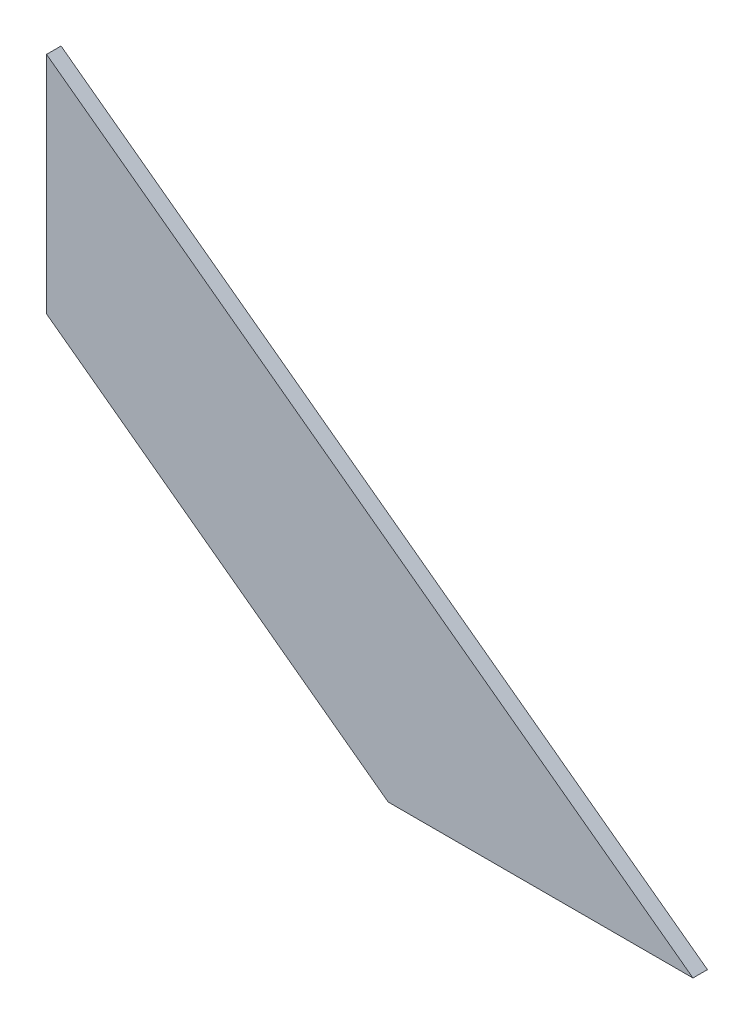
ISO-10303-21;
HEADER;
FILE_DESCRIPTION(('STEP AP214'),'2;1');
FILE_NAME('part.step','',(''),(''),'','','');
FILE_SCHEMA(('AUTOMOTIVE_DESIGN { 1 0 10303 214 1 1 1 1 }'));
ENDSEC;
DATA;
#1=APPLICATION_CONTEXT('core data for automotive mechanical design processes');
#2=APPLICATION_PROTOCOL_DEFINITION('international standard','automotive_design',2000,#1);
#3=PRODUCT_CONTEXT('',#1,'mechanical');
#4=PRODUCT('Part','Part','',(#3));
#5=PRODUCT_RELATED_PRODUCT_CATEGORY('part','',(#4));
#6=PRODUCT_DEFINITION_FORMATION('','',#4);
#7=PRODUCT_DEFINITION_CONTEXT('part definition',#1,'design');
#8=PRODUCT_DEFINITION('design','',#6,#7);
#9=PRODUCT_DEFINITION_SHAPE('','',#8);
#10=(LENGTH_UNIT() NAMED_UNIT(*) SI_UNIT(.MILLI.,.METRE.));
#11=(NAMED_UNIT(*) PLANE_ANGLE_UNIT() SI_UNIT($,.RADIAN.));
#12=(NAMED_UNIT(*) SI_UNIT($,.STERADIAN.) SOLID_ANGLE_UNIT());
#13=UNCERTAINTY_MEASURE_WITH_UNIT(LENGTH_MEASURE(1.E-05),#10,'distance_accuracy_value','');
#14=(GEOMETRIC_REPRESENTATION_CONTEXT(3) GLOBAL_UNCERTAINTY_ASSIGNED_CONTEXT((#13)) GLOBAL_UNIT_ASSIGNED_CONTEXT((#10,
#11,#12)) REPRESENTATION_CONTEXT('',''));
#15=CARTESIAN_POINT('',(0.,0.,0.));
#16=DIRECTION('',(0.,0.,1.));
#17=DIRECTION('',(1.,0.,0.));
#18=AXIS2_PLACEMENT_3D('',#15,#16,#17);
#19=CARTESIAN_POINT('',(-503.389866918467,-20.0348288869536,-1.524));
#20=DIRECTION('',(0.,1.,0.));
#21=DIRECTION('',(-1.,0.,0.));
#22=AXIS2_PLACEMENT_3D('',#19,#20,#21);
#23=PLANE('',#22);
#24=DIRECTION('',(-1.,0.,0.));
#25=VECTOR('',#24,1.);
#26=CARTESIAN_POINT('',(-503.389866918467,-20.0348288869536,0.));
#27=LINE('',#26,#25);
#28=CARTESIAN_POINT('',(-471.292522592368,-20.0348288869538,0.));
#29=VERTEX_POINT('',#28);
#30=CARTESIAN_POINT('',(-503.389866918467,-20.0348288869536,0.));
#31=VERTEX_POINT('',#30);
#32=EDGE_CURVE('E96',#29,#31,#27,.T.);
#33=ORIENTED_EDGE('',*,*,#32,.T.);
#34=DIRECTION('',(0.,0.,1.));
#35=VECTOR('',#34,1.);
#36=CARTESIAN_POINT('',(-503.389866918467,-20.0348288869536,-1.524));
#37=LINE('',#36,#35);
#38=CARTESIAN_POINT('',(-503.389866918467,-20.0348288869536,-1.524));
#39=VERTEX_POINT('',#38);
#40=EDGE_CURVE('E11',#39,#31,#37,.T.);
#41=ORIENTED_EDGE('',*,*,#40,.F.);
#42=DIRECTION('',(-1.,0.,0.));
#43=VECTOR('',#42,1.);
#44=CARTESIAN_POINT('',(-503.389866918467,-20.0348288869536,-1.524));
#45=LINE('',#44,#43);
#46=CARTESIAN_POINT('',(-471.292522592368,-20.0348288869538,-1.524));
#47=VERTEX_POINT('',#46);
#48=EDGE_CURVE('E84',#47,#39,#45,.T.);
#49=ORIENTED_EDGE('',*,*,#48,.F.);
#50=DIRECTION('',(0.,0.,1.));
#51=VECTOR('',#50,1.);
#52=CARTESIAN_POINT('',(-471.292522592368,-20.0348288869538,-1.524));
#53=LINE('',#52,#51);
#54=EDGE_CURVE('E92',#47,#29,#53,.T.);
#55=ORIENTED_EDGE('',*,*,#54,.T.);
#56=EDGE_LOOP('',(#33,#41,#49,#55));
#57=FACE_BOUND('',#56,.T.);
#58=ADVANCED_FACE('F33',(#57),#23,.F.);
#59=CARTESIAN_POINT('',(-539.362495023417,6.49256227669723,-1.524));
#60=DIRECTION('',(0.593507045519333,0.804828793544883,0.));
#61=DIRECTION('',(-0.804828793544883,0.593507045519333,0.));
#62=AXIS2_PLACEMENT_3D('',#59,#60,#61);
#63=PLANE('',#62);
#64=DIRECTION('',(-0.804828793544883,0.593507045519333,0.));
#65=VECTOR('',#64,1.);
#66=CARTESIAN_POINT('',(-539.362495023417,6.49256227669723,0.));
#67=LINE('',#66,#65);
#68=CARTESIAN_POINT('',(-539.362495023417,6.49256227669723,0.));
#69=VERTEX_POINT('',#68);
#70=EDGE_CURVE('E88',#31,#69,#67,.T.);
#71=ORIENTED_EDGE('',*,*,#70,.T.);
#72=DIRECTION('',(0.,0.,1.));
#73=VECTOR('',#72,1.);
#74=CARTESIAN_POINT('',(-539.362495023417,6.49256227669723,-1.524));
#75=LINE('',#74,#73);
#76=CARTESIAN_POINT('',(-539.362495023417,6.49256227669723,-1.524));
#77=VERTEX_POINT('',#76);
#78=EDGE_CURVE('E41',#77,#69,#75,.T.);
#79=ORIENTED_EDGE('',*,*,#78,.F.);
#80=DIRECTION('',(-0.804828793544883,0.593507045519333,0.));
#81=VECTOR('',#80,1.);
#82=CARTESIAN_POINT('',(-539.362495023417,6.49256227669723,-1.524));
#83=LINE('',#82,#81);
#84=EDGE_CURVE('E79',#39,#77,#83,.T.);
#85=ORIENTED_EDGE('',*,*,#84,.F.);
#86=ORIENTED_EDGE('',*,*,#40,.T.);
#87=EDGE_LOOP('',(#71,#79,#85,#86));
#88=FACE_BOUND('',#87,.T.);
#89=ADVANCED_FACE('F87',(#88),#63,.F.);
#90=CARTESIAN_POINT('',(-539.362495023417,30.1621925791791,-1.524));
#91=DIRECTION('',(1.,0.,0.));
#92=DIRECTION('',(0.,0.,-1.));
#93=AXIS2_PLACEMENT_3D('',#90,#91,#92);
#94=PLANE('',#93);
#95=DIRECTION('',(0.,1.,0.));
#96=VECTOR('',#95,1.);
#97=CARTESIAN_POINT('',(-539.362495023417,30.1621925791791,0.));
#98=LINE('',#97,#96);
#99=CARTESIAN_POINT('',(-539.362495023417,30.1621925791791,0.));
#100=VERTEX_POINT('',#99);
#101=EDGE_CURVE('E66',#69,#100,#98,.T.);
#102=ORIENTED_EDGE('',*,*,#101,.T.);
#103=DIRECTION('',(0.,0.,1.));
#104=VECTOR('',#103,1.);
#105=CARTESIAN_POINT('',(-539.362495023417,30.1621925791791,-1.524));
#106=LINE('',#105,#104);
#107=CARTESIAN_POINT('',(-539.362495023417,30.1621925791791,-1.524));
#108=VERTEX_POINT('',#107);
#109=EDGE_CURVE('E89',#108,#100,#106,.T.);
#110=ORIENTED_EDGE('',*,*,#109,.F.);
#111=DIRECTION('',(0.,1.,0.));
#112=VECTOR('',#111,1.);
#113=CARTESIAN_POINT('',(-539.362495023417,30.1621925791791,-1.524));
#114=LINE('',#113,#112);
#115=EDGE_CURVE('E82',#77,#108,#114,.T.);
#116=ORIENTED_EDGE('',*,*,#115,.F.);
#117=ORIENTED_EDGE('',*,*,#78,.T.);
#118=EDGE_LOOP('',(#102,#110,#116,#117));
#119=FACE_BOUND('',#118,.T.);
#120=ADVANCED_FACE('F90',(#119),#94,.F.);
#121=CARTESIAN_POINT('',(-471.292522592368,-20.0348288869538,-1.524));
#122=DIRECTION('',(-0.593507045519333,-0.804828793544883,0.));
#123=DIRECTION('',(0.804828793544883,-0.593507045519333,0.));
#124=AXIS2_PLACEMENT_3D('',#121,#122,#123);
#125=PLANE('',#124);
#126=DIRECTION('',(0.804828793544883,-0.593507045519333,0.));
#127=VECTOR('',#126,1.);
#128=CARTESIAN_POINT('',(-471.292522592368,-20.0348288869538,0.));
#129=LINE('',#128,#127);
#130=EDGE_CURVE('E72',#100,#29,#129,.T.);
#131=ORIENTED_EDGE('',*,*,#130,.T.);
#132=ORIENTED_EDGE('',*,*,#54,.F.);
#133=DIRECTION('',(0.804828793544883,-0.593507045519333,0.));
#134=VECTOR('',#133,1.);
#135=CARTESIAN_POINT('',(-471.292522592368,-20.0348288869538,-1.524));
#136=LINE('',#135,#134);
#137=EDGE_CURVE('E49',#108,#47,#136,.T.);
#138=ORIENTED_EDGE('',*,*,#137,.F.);
#139=ORIENTED_EDGE('',*,*,#109,.T.);
#140=EDGE_LOOP('',(#131,#132,#138,#139));
#141=FACE_BOUND('',#140,.T.);
#142=ADVANCED_FACE('F103',(#141),#125,.F.);
#143=CARTESIAN_POINT('',(0.,0.,-1.524));
#144=DIRECTION('',(0.,0.,-1.));
#145=DIRECTION('',(-1.,0.,0.));
#146=AXIS2_PLACEMENT_3D('',#143,#144,#145);
#147=PLANE('',#146);
#148=ORIENTED_EDGE('',*,*,#48,.T.);
#149=ORIENTED_EDGE('',*,*,#84,.T.);
#150=ORIENTED_EDGE('',*,*,#115,.T.);
#151=ORIENTED_EDGE('',*,*,#137,.T.);
#152=EDGE_LOOP('',(#148,#149,#150,#151));
#153=FACE_BOUND('',#152,.T.);
#154=ADVANCED_FACE('F80',(#153),#147,.T.);
#155=CARTESIAN_POINT('',(0.,0.,0.));
#156=DIRECTION('',(0.,0.,-1.));
#157=DIRECTION('',(-1.,0.,0.));
#158=AXIS2_PLACEMENT_3D('',#155,#156,#157);
#159=PLANE('',#158);
#160=ORIENTED_EDGE('',*,*,#32,.F.);
#161=ORIENTED_EDGE('',*,*,#130,.F.);
#162=ORIENTED_EDGE('',*,*,#101,.F.);
#163=ORIENTED_EDGE('',*,*,#70,.F.);
#164=EDGE_LOOP('',(#160,#161,#162,#163));
#165=FACE_BOUND('',#164,.T.);
#166=ADVANCED_FACE('F106',(#165),#159,.F.);
#167=CLOSED_SHELL('',(#58,#89,#120,#142,#154,#166));
#168=MANIFOLD_SOLID_BREP('B2',#167);
#169=ADVANCED_BREP_SHAPE_REPRESENTATION('',(#18,#168),#14);
#170=SHAPE_DEFINITION_REPRESENTATION(#9,#169);
ENDSEC;
END-ISO-10303-21;
